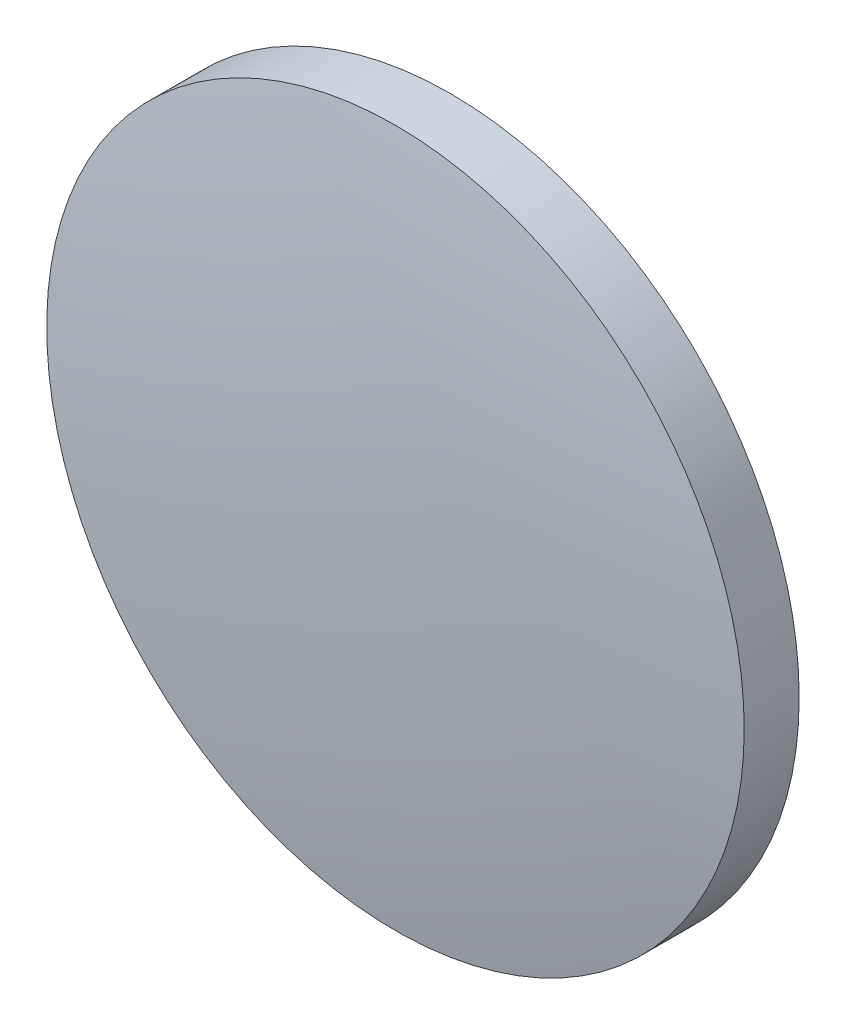
ISO-10303-21;
HEADER;
FILE_DESCRIPTION(('STEP AP214'),'2;1');
FILE_NAME('part.step','',(''),(''),'','','');
FILE_SCHEMA(('AUTOMOTIVE_DESIGN { 1 0 10303 214 1 1 1 1 }'));
ENDSEC;
DATA;
#1=APPLICATION_CONTEXT('core data for automotive mechanical design processes');
#2=APPLICATION_PROTOCOL_DEFINITION('international standard','automotive_design',2000,#1);
#3=PRODUCT_CONTEXT('',#1,'mechanical');
#4=PRODUCT('Part','Part','',(#3));
#5=PRODUCT_RELATED_PRODUCT_CATEGORY('part','',(#4));
#6=PRODUCT_DEFINITION_FORMATION('','',#4);
#7=PRODUCT_DEFINITION_CONTEXT('part definition',#1,'design');
#8=PRODUCT_DEFINITION('design','',#6,#7);
#9=PRODUCT_DEFINITION_SHAPE('','',#8);
#10=(LENGTH_UNIT() NAMED_UNIT(*) SI_UNIT(.MILLI.,.METRE.));
#11=(NAMED_UNIT(*) PLANE_ANGLE_UNIT() SI_UNIT($,.RADIAN.));
#12=(NAMED_UNIT(*) SI_UNIT($,.STERADIAN.) SOLID_ANGLE_UNIT());
#13=UNCERTAINTY_MEASURE_WITH_UNIT(LENGTH_MEASURE(1.E-05),#10,'distance_accuracy_value','');
#14=(GEOMETRIC_REPRESENTATION_CONTEXT(3) GLOBAL_UNCERTAINTY_ASSIGNED_CONTEXT((#13)) GLOBAL_UNIT_ASSIGNED_CONTEXT((#10,
#11,#12)) REPRESENTATION_CONTEXT('',''));
#15=CARTESIAN_POINT('',(0.,0.,0.));
#16=DIRECTION('',(0.,0.,1.));
#17=DIRECTION('',(1.,0.,0.));
#18=AXIS2_PLACEMENT_3D('',#15,#16,#17);
#19=CARTESIAN_POINT('',(0.,0.,-81.8724437645739));
#20=DIRECTION('',(0.,0.,1.));
#21=DIRECTION('',(0.,1.,0.));
#22=AXIS2_PLACEMENT_3D('',#19,#20,#21);
#23=SPHERICAL_SURFACE('',#22,83.36);
#24=CARTESIAN_POINT('',(0.,0.,0.514445969169492));
#25=DIRECTION('',(0.,0.,1.));
#26=DIRECTION('',(1.,0.,0.));
#27=AXIS2_PLACEMENT_3D('',#24,#25,#26);
#28=CIRCLE('',#27,12.7);
#29=CARTESIAN_POINT('',(12.7,0.,0.514445969169492));
#30=VERTEX_POINT('',#29);
#31=EDGE_CURVE('E8',#30,#30,#28,.T.);
#32=ORIENTED_EDGE('',*,*,#31,.T.);
#33=EDGE_LOOP('',(#32));
#34=FACE_BOUND('',#33,.T.);
#35=ADVANCED_FACE('F12',(#34),#23,.T.);
#36=CARTESIAN_POINT('',(0.,0.,9.07765999026711));
#37=DIRECTION('',(0.,0.,1.));
#38=DIRECTION('',(1.,0.,0.));
#39=AXIS2_PLACEMENT_3D('',#36,#37,#38);
#40=CYLINDRICAL_SURFACE('',#39,12.7);
#41=ORIENTED_EDGE('',*,*,#31,.F.);
#42=EDGE_LOOP('',(#41));
#43=FACE_BOUND('',#42,.T.);
#44=CARTESIAN_POINT('',(0.,0.,-1.48755623542605));
#45=DIRECTION('',(0.,0.,1.));
#46=DIRECTION('',(1.,0.,0.));
#47=AXIS2_PLACEMENT_3D('',#44,#45,#46);
#48=CIRCLE('',#47,12.7);
#49=CARTESIAN_POINT('',(12.7,0.,-1.48755623542605));
#50=VERTEX_POINT('',#49);
#51=EDGE_CURVE('E18',#50,#50,#48,.T.);
#52=ORIENTED_EDGE('',*,*,#51,.T.);
#53=EDGE_LOOP('',(#52));
#54=FACE_BOUND('',#53,.T.);
#55=ADVANCED_FACE('F24',(#43,#54),#40,.T.);
#56=CARTESIAN_POINT('',(0.,0.,-234.992443764574));
#57=DIRECTION('',(0.,0.,1.));
#58=DIRECTION('',(0.,1.,0.));
#59=AXIS2_PLACEMENT_3D('',#56,#57,#58);
#60=SPHERICAL_SURFACE('',#59,233.85);
#61=ORIENTED_EDGE('',*,*,#51,.F.);
#62=EDGE_LOOP('',(#61));
#63=FACE_BOUND('',#62,.T.);
#64=ADVANCED_FACE('F26',(#63),#60,.F.);
#65=CLOSED_SHELL('',(#35,#55,#64));
#66=MANIFOLD_SOLID_BREP('B1',#65);
#67=ADVANCED_BREP_SHAPE_REPRESENTATION('',(#18,#66),#14);
#68=SHAPE_DEFINITION_REPRESENTATION(#9,#67);
ENDSEC;
END-ISO-10303-21;
